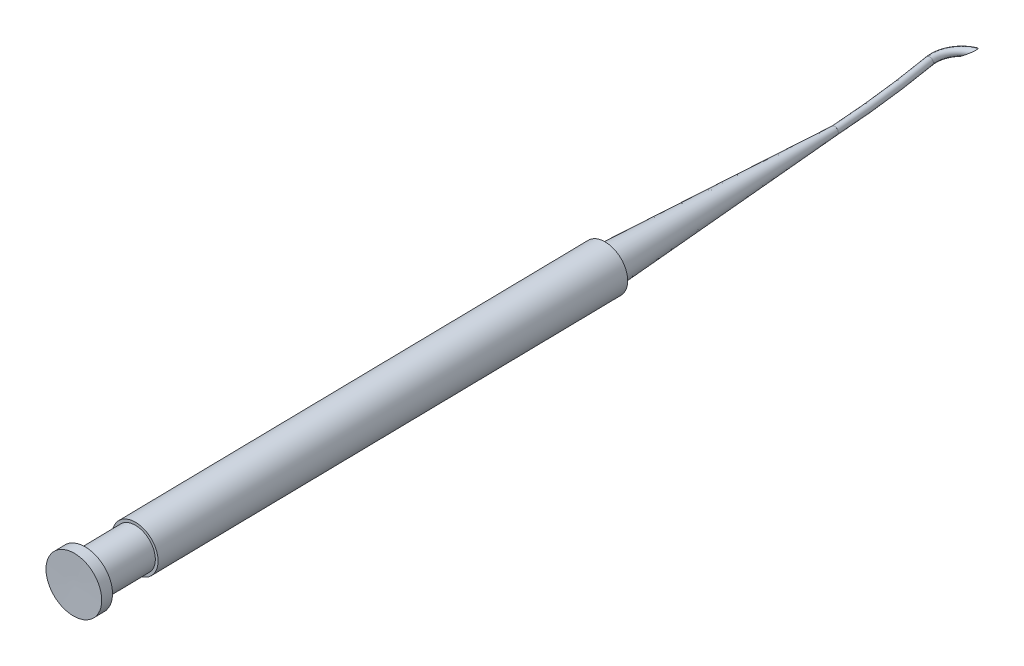
ISO-10303-21;
HEADER;
FILE_DESCRIPTION(('STEP AP214'),'2;1');
FILE_NAME('part.step','',(''),(''),'','','');
FILE_SCHEMA(('AUTOMOTIVE_DESIGN { 1 0 10303 214 1 1 1 1 }'));
ENDSEC;
DATA;
#1=APPLICATION_CONTEXT('core data for automotive mechanical design processes');
#2=APPLICATION_PROTOCOL_DEFINITION('international standard','automotive_design',2000,#1);
#3=PRODUCT_CONTEXT('',#1,'mechanical');
#4=PRODUCT('Part','Part','',(#3));
#5=PRODUCT_RELATED_PRODUCT_CATEGORY('part','',(#4));
#6=PRODUCT_DEFINITION_FORMATION('','',#4);
#7=PRODUCT_DEFINITION_CONTEXT('part definition',#1,'design');
#8=PRODUCT_DEFINITION('design','',#6,#7);
#9=PRODUCT_DEFINITION_SHAPE('','',#8);
#10=(LENGTH_UNIT() NAMED_UNIT(*) SI_UNIT(.MILLI.,.METRE.));
#11=(NAMED_UNIT(*) PLANE_ANGLE_UNIT() SI_UNIT($,.RADIAN.));
#12=(NAMED_UNIT(*) SI_UNIT($,.STERADIAN.) SOLID_ANGLE_UNIT());
#13=UNCERTAINTY_MEASURE_WITH_UNIT(LENGTH_MEASURE(1.E-05),#10,'distance_accuracy_value','');
#14=(GEOMETRIC_REPRESENTATION_CONTEXT(3) GLOBAL_UNCERTAINTY_ASSIGNED_CONTEXT((#13)) GLOBAL_UNIT_ASSIGNED_CONTEXT((#10,
#11,#12)) REPRESENTATION_CONTEXT('',''));
#15=CARTESIAN_POINT('',(0.,0.,0.));
#16=DIRECTION('',(0.,0.,1.));
#17=DIRECTION('',(1.,0.,0.));
#18=AXIS2_PLACEMENT_3D('',#15,#16,#17);
#19=CARTESIAN_POINT('',(22.5831114339788,9.8277538825437E-11,-64.5016753142618));
#20=DIRECTION('',(-0.109478747496273,1.17499877810958E-08,-0.993989136684424));
#21=DIRECTION('',(6.96705910834885E-07,-0.999999999999753,-8.8556780978676E-08));
#22=AXIS2_PLACEMENT_3D('',#19,#20,#21);
#23=ELLIPSE('',#22,0.499930018106646,0.499860046008388);
#24=CARTESIAN_POINT('',(26.3470233288516,0.,-65.1616041607414));
#25=DIRECTION('',(0.,-1.,0.));
#26=AXIS1_PLACEMENT('',#24,#25);
#27=SURFACE_OF_REVOLUTION('',#23,#26);
#28=CARTESIAN_POINT('',(22.583111782283,-0.499930018008245,-64.501675358534));
#29=VERTEX_POINT('',#28);
#30=EDGE_CURVE('E11',#29,#29,#23,.T.);
#31=ORIENTED_EDGE('',*,*,#30,.T.);
#32=EDGE_LOOP('',(#31));
#33=FACE_BOUND('',#32,.T.);
#34=CARTESIAN_POINT('',(23.4789167075342,-0.499930018008245,-67.6867775336271));
#35=CARTESIAN_POINT('',(23.4874966298607,-0.499922539838258,-67.6596179954472));
#36=CARTESIAN_POINT('',(23.4991178717487,-0.498113027047626,-67.633192326966));
#37=CARTESIAN_POINT('',(23.5220054699255,-0.491710849953837,-67.5974919130645));
#38=CARTESIAN_POINT('',(23.5306238073087,-0.488929440464561,-67.5861832491793));
#39=CARTESIAN_POINT('',(23.5495695594943,-0.482079781529989,-67.5655570977329));
#40=CARTESIAN_POINT('',(23.5598947935907,-0.478013168074712,-67.5562371038382));
#41=CARTESIAN_POINT('',(23.5802328042653,-0.469427725007459,-67.5411916823178));
#42=CARTESIAN_POINT('',(23.5900722557496,-0.465060905489362,-67.5351404864551));
#43=CARTESIAN_POINT('',(23.6103701263734,-0.455677162211372,-67.524819048566));
#44=CARTESIAN_POINT('',(23.6208296507264,-0.450659057451415,-67.5205521028228));
#45=CARTESIAN_POINT('',(23.6465426982068,-0.43794732030239,-67.5122249108725));
#46=CARTESIAN_POINT('',(23.6619523396238,-0.430019913611097,-67.5090157962757));
#47=CARTESIAN_POINT('',(23.6928245190423,-0.413668675975096,-67.5052883362523));
#48=CARTESIAN_POINT('',(23.7082870954326,-0.405243703576949,-67.5047764417567));
#49=CARTESIAN_POINT('',(23.737902559818,-0.388766205218424,-67.5057604163133));
#50=CARTESIAN_POINT('',(23.7520706037626,-0.380729598879681,-67.5071165661881));
#51=CARTESIAN_POINT('',(23.7801289796391,-0.364573667587392,-67.5111856553017));
#52=CARTESIAN_POINT('',(23.7940196214762,-0.356454452237391,-67.5138969808756));
#53=CARTESIAN_POINT('',(23.8215780275406,-0.340153652987961,-67.5203853907922));
#54=CARTESIAN_POINT('',(23.8352447778734,-0.33197194948345,-67.5241663783844));
#55=CARTESIAN_POINT('',(23.862315529857,-0.315607230266437,-67.5325689527492));
#56=CARTESIAN_POINT('',(23.8757194846719,-0.307424214577414,-67.5371906878794));
#57=CARTESIAN_POINT('',(23.9131667048235,-0.284378342511033,-67.5511656999159));
#58=CARTESIAN_POINT('',(23.9369315235763,-0.26953425252005,-67.5612937308752));
#59=CARTESIAN_POINT('',(23.9838007444835,-0.2399390323592,-67.5831083650033));
#60=CARTESIAN_POINT('',(24.0069046819498,-0.225187973020344,-67.5947960336085));
#61=CARTESIAN_POINT('',(24.0754823582676,-0.181035770327077,-67.6316051845266));
#62=CARTESIAN_POINT('',(24.1201344409228,-0.151790135457073,-67.6584362847414));
#63=CARTESIAN_POINT('',(24.2080464302558,-0.0935580425619982,-67.7150199966887));
#64=CARTESIAN_POINT('',(24.2512991348245,-0.0645733527040405,-67.7447852613265));
#65=CARTESIAN_POINT('',(24.3364346274478,-0.00699351117532545,-67.8064160904951));
#66=CARTESIAN_POINT('',(24.3783191605603,0.0216021072052781,-67.8382788097071));
#67=CARTESIAN_POINT('',(24.4568481353309,0.0756991068713183,-67.9008008977525));
#68=CARTESIAN_POINT('',(24.4936102773659,0.101234562084873,-67.9312833004158));
#69=CARTESIAN_POINT('',(24.5659116152841,0.151929616554021,-67.9939612209899));
#70=CARTESIAN_POINT('',(24.6014509539131,0.177089259485272,-68.0261565378161));
#71=CARTESIAN_POINT('',(24.6708393786765,0.226827798323792,-68.09256208874));
#72=CARTESIAN_POINT('',(24.7046922190613,0.251407913488138,-68.1267674406523));
#73=CARTESIAN_POINT('',(24.7699951949769,0.299719555552766,-68.1979096223693));
#74=CARTESIAN_POINT('',(24.8014481871818,0.323452072905243,-68.2348430982604));
#75=CARTESIAN_POINT('',(24.8554032558391,0.365513521509206,-68.305974306849));
#76=CARTESIAN_POINT('',(24.878515193272,0.384070965688318,-68.339554286647));
#77=CARTESIAN_POINT('',(24.9097141439607,0.410460886887004,-68.3925948880169));
#78=CARTESIAN_POINT('',(24.9195165470632,0.418998020381074,-68.4106743817307));
#79=CARTESIAN_POINT('',(24.9375847063136,0.43540519955492,-68.4478641190111));
#80=CARTESIAN_POINT('',(24.9458500252793,0.443275055100273,-68.4669746538416));
#81=CARTESIAN_POINT('',(24.9651088901834,0.462999797497797,-68.5194922396621));
#82=CARTESIAN_POINT('',(24.97429834211,0.474053290575408,-68.5540046282334));
#83=CARTESIAN_POINT('',(24.9807397230262,0.48695652639981,-68.6078808285763));
#84=CARTESIAN_POINT('',(24.9816409056787,0.490658613966195,-68.6263407510652));
#85=CARTESIAN_POINT('',(24.9802622323442,0.496336903765829,-68.6634081827675));
#86=CARTESIAN_POINT('',(24.9779915578946,0.498318060666896,-68.6820151116074));
#87=CARTESIAN_POINT('',(24.9709072673643,0.499993472269842,-68.7141230623619));
#88=CARTESIAN_POINT('',(24.9668435578089,0.500125692017693,-68.7277683711388));
#89=CARTESIAN_POINT('',(24.9567473800998,0.499168574704634,-68.7542670393061));
#90=CARTESIAN_POINT('',(24.950715091339,0.498079348929742,-68.7671204707322));
#91=CARTESIAN_POINT('',(24.9369407014494,0.494753154595339,-68.7916394276025));
#92=CARTESIAN_POINT('',(24.9292051402428,0.49252053390272,-68.8033092538599));
#93=CARTESIAN_POINT('',(24.9123305356752,0.487056331570419,-68.8253464878663));
#94=CARTESIAN_POINT('',(24.9031885634689,0.483822650664441,-68.8357110936466));
#95=CARTESIAN_POINT('',(24.8795434039081,0.474912354015089,-68.8593712627208));
#96=CARTESIAN_POINT('',(24.8644637242696,0.468788811244467,-68.8719211259236));
#97=CARTESIAN_POINT('',(24.8329329347905,0.455317201228225,-68.8943179881911));
#98=CARTESIAN_POINT('',(24.8164796927668,0.447967211818271,-68.9041606792511));
#99=CARTESIAN_POINT('',(24.7736534000257,0.42820232655429,-68.9261323510813));
#100=CARTESIAN_POINT('',(24.7467206293752,0.415195349504142,-68.9366266379133));
#101=CARTESIAN_POINT('',(24.6921115949708,0.387974875095077,-68.9530251465872));
#102=CARTESIAN_POINT('',(24.664433926231,0.373758969939492,-68.9589199585129));
#103=CARTESIAN_POINT('',(24.5916568693747,0.335511027576955,-68.9694224452733));
#104=CARTESIAN_POINT('',(24.546432758619,0.310874899963703,-68.970947118899));
#105=CARTESIAN_POINT('',(24.4568984012815,0.260765570710296,-68.9662790799544));
#106=CARTESIAN_POINT('',(24.412590240764,0.235290741499975,-68.9600703817609));
#107=CARTESIAN_POINT('',(24.3050282875379,0.172030851302187,-68.9368360446869));
#108=CARTESIAN_POINT('',(24.2426620946954,0.134089613158125,-68.9160969860722));
#109=CARTESIAN_POINT('',(24.1225717181909,0.0588247573493645,-68.8634577448738));
#110=CARTESIAN_POINT('',(24.0648490196514,0.0215013402889497,-68.8315540088234));
#111=CARTESIAN_POINT('',(23.9535113806371,-0.0527047813911042,-68.7572605928567));
#112=CARTESIAN_POINT('',(23.9000354623301,-0.0895530580752701,-68.714628384566));
#113=CARTESIAN_POINT('',(23.7997290483326,-0.161134029886636,-68.6204764933182));
#114=CARTESIAN_POINT('',(23.7529125367563,-0.195862188215514,-68.5689385972947));
#115=CARTESIAN_POINT('',(23.6607489040934,-0.267328339788732,-68.4496312111193));
#116=CARTESIAN_POINT('',(23.6166488268582,-0.303600887394179,-68.3805880735038));
#117=CARTESIAN_POINT('',(23.5604398690361,-0.353702808534918,-68.2703046880576));
#118=CARTESIAN_POINT('',(23.5433792232419,-0.369664178874372,-68.2324876618111));
#119=CARTESIAN_POINT('',(23.5130732009439,-0.399857506943634,-68.1547155081922));
#120=CARTESIAN_POINT('',(23.4998227803194,-0.414091736554149,-68.1147632913834));
#121=CARTESIAN_POINT('',(23.4800666254365,-0.437819019589966,-68.0407751943486));
#122=CARTESIAN_POINT('',(23.4727535852037,-0.447697298103827,-68.0070806956675));
#123=CARTESIAN_POINT('',(23.4618555497138,-0.465606902571051,-67.9385069522294));
#124=CARTESIAN_POINT('',(23.4582773539547,-0.473634839248143,-67.9036256656076));
#125=CARTESIAN_POINT('',(23.4562215016887,-0.486162908033941,-67.8380054319947));
#126=CARTESIAN_POINT('',(23.4571057804647,-0.490997735336491,-67.807362245954));
#127=CARTESIAN_POINT('',(23.4621681137548,-0.49615133724932,-67.7616370130987));
#128=CARTESIAN_POINT('',(23.4644674418326,-0.497518578106189,-67.7464742491026));
#129=CARTESIAN_POINT('',(23.4705193053329,-0.499410121126964,-67.7163950890753));
#130=CARTESIAN_POINT('',(23.4742724560723,-0.499934065888934,-67.7014788001533));
#131=CARTESIAN_POINT('',(23.4789167075342,-0.499930018008245,-67.6867775336271));
#132=B_SPLINE_CURVE_WITH_KNOTS('',3,(#34,#35,#36,#37,#38,#39,#40,#41,#42,#43,#44,#45,#46,#47,
#48,#49,#50,#51,#52,#53,#54,#55,#56,#57,#58,#59,#60,#61,#62,#63,#64,#65,#66,#67,#68,#69,#70,#71,
#72,#73,#74,#75,#76,#77,#78,#79,#80,#81,#82,#83,#84,#85,#86,#87,#88,#89,#90,#91,#92,#93,#94,#95,
#96,#97,#98,#99,#100,#101,#102,#103,#104,#105,#106,#107,#108,#109,#110,#111,#112,#113,#114,#115,
#116,#117,#118,#119,#120,#121,#122,#123,#124,#125,#126,#127,#128,#129,#130,#131),.UNSPECIFIED.,
.T.,.F.,(4,2,2,2,2,2,2,2,2,2,2,2,2,2,2,2,2,2,2,2,2,2,2,2,2,2,2,2,2,2,2,2,2,2,2,2,2,2,2,2,2,2,2,
2,2,2,2,2,4),(0.,0.0852063214918791,0.128417850991578,0.171574594786311,0.208448829189027,
0.245390888487316,0.297961542778718,0.350657873221296,0.399619614890309,0.448523194139345,
0.497607579136256,0.546700633933774,0.636006070123902,0.725372828943218,0.904433292210296,
1.08430283095376,1.26393320361352,1.4263614905045,1.58877075130074,1.75080065015548,
1.9126345650802,2.04670359965181,2.11342377830948,2.18016290479438,2.29098532503552,
2.34726672830694,2.40338555164556,2.4458999750825,2.48841052534095,2.53076061240355,
2.57320011800483,2.63450850384706,2.69591389441808,2.79047202555921,2.88522310653068,
3.03892907081035,3.19295328804407,3.41939855173804,3.64591595353208,3.87810443446597,
4.11077351006566,4.37793987580824,4.51111027966967,4.64410356720939,4.75149849939878,
4.85908861098387,4.95177021644145,4.9978722638897,5.04399384495915),.UNSPECIFIED.);
#133=CARTESIAN_POINT('',(23.4789167075342,-0.499930018008245,-67.6867775336271));
#134=VERTEX_POINT('',#133);
#135=EDGE_CURVE('E79',#134,#134,#132,.T.);
#136=ORIENTED_EDGE('',*,*,#135,.T.);
#137=EDGE_LOOP('',(#136));
#138=FACE_BOUND('',#137,.T.);
#139=ADVANCED_FACE('F42',(#33,#138),#27,.F.);
#140=CARTESIAN_POINT('',(22.5831114339788,9.8277538825437E-11,-64.5016753142618));
#141=DIRECTION('',(-0.109478747496273,1.17499877810958E-08,-0.993989136684424));
#142=DIRECTION('',(1.28637394537087E-09,1.,1.16793602105839E-08));
#143=AXIS2_PLACEMENT_3D('',#140,#141,#142);
#144=CIRCLE('',#143,0.150000000000002);
#145=CARTESIAN_POINT('',(26.3470233288516,0.,-65.1616041607414));
#146=DIRECTION('',(0.,-1.,0.));
#147=AXIS1_PLACEMENT('',#145,#146);
#148=SURFACE_OF_REVOLUTION('',#144,#147);
#149=CARTESIAN_POINT('',(22.5831114341717,0.150000000098279,-64.5016753125099));
#150=VERTEX_POINT('',#149);
#151=EDGE_CURVE('E50',#150,#150,#144,.T.);
#152=ORIENTED_EDGE('',*,*,#151,.F.);
#153=EDGE_LOOP('',(#152));
#154=FACE_BOUND('',#153,.T.);
#155=CARTESIAN_POINT('',(24.4157371071417,0.150000000098279,-68.4589777163875));
#156=CARTESIAN_POINT('',(24.4142710853937,0.150000076328208,-68.4636261695504));
#157=CARTESIAN_POINT('',(24.4124264922115,0.149771197351919,-68.4681565266262));
#158=CARTESIAN_POINT('',(24.407996312203,0.14883047526385,-68.4767855848725));
#159=CARTESIAN_POINT('',(24.4054109731304,0.148118793524122,-68.480884429743));
#160=CARTESIAN_POINT('',(24.3996298090631,0.146253939627511,-68.4884755007737));
#161=CARTESIAN_POINT('',(24.3964367746203,0.145102762236857,-68.4919703656355));
#162=CARTESIAN_POINT('',(24.3895921452486,0.142437384493779,-68.4983236240004));
#163=CARTESIAN_POINT('',(24.3859392136371,0.140922113748895,-68.5011800919848));
#164=CARTESIAN_POINT('',(24.3722910159743,0.134993995519197,-68.5103167298816));
#165=CARTESIAN_POINT('',(24.3614490571251,0.129805719551828,-68.5148163135146));
#166=CARTESIAN_POINT('',(24.3413683755161,0.119694529003867,-68.5202604157134));
#167=CARTESIAN_POINT('',(24.3321695772978,0.114875826470541,-68.5216784206928));
#168=CARTESIAN_POINT('',(24.3137742002582,0.104978710268638,-68.5230119424734));
#169=CARTESIAN_POINT('',(24.3045776895042,0.0998996533963149,-68.5229235398142));
#170=CARTESIAN_POINT('',(24.2788253887357,0.0853929683666589,-68.521039633179));
#171=CARTESIAN_POINT('',(24.2624540055977,0.0758328639094346,-68.5178966518499));
#172=CARTESIAN_POINT('',(24.2304894342157,0.0566811943063825,-68.5089622715144));
#173=CARTESIAN_POINT('',(24.2148981053724,0.0470896071275913,-68.5031648504195));
#174=CARTESIAN_POINT('',(24.1755083555094,0.0223183960099349,-68.4854138846467));
#175=CARTESIAN_POINT('',(24.1523758029141,0.00722609490043105,-68.4718520242186));
#176=CARTESIAN_POINT('',(24.1085932952459,-0.0223075205993808,-68.440605709956));
#177=CARTESIAN_POINT('',(24.0879477502232,-0.0367476510085163,-68.4229140916036));
#178=CARTESIAN_POINT('',(24.0531632149437,-0.0620720554242716,-68.3873769559858));
#179=CARTESIAN_POINT('',(24.0385235032155,-0.0731258437272038,-68.370142887424));
#180=CARTESIAN_POINT('',(24.0118895338344,-0.0941914602194916,-68.3332870983584));
#181=CARTESIAN_POINT('',(23.999882553516,-0.104208170185414,-68.3136776050732));
#182=CARTESIAN_POINT('',(23.9817683502355,-0.120676730825175,-68.2762804074247));
#183=CARTESIAN_POINT('',(23.9749489566109,-0.127433207029412,-68.2589965616805));
#184=CARTESIAN_POINT('',(23.9675395223182,-0.136250041297197,-68.2317196183609));
#185=CARTESIAN_POINT('',(23.9655363147787,-0.138981630016445,-68.2223419226479));
#186=CARTESIAN_POINT('',(23.9628896706269,-0.143754836759356,-68.2032483285854));
#187=CARTESIAN_POINT('',(23.962240546928,-0.145799310129542,-68.1935340196452));
#188=CARTESIAN_POINT('',(23.9629158322241,-0.14882076894991,-68.1739950655551));
#189=CARTESIAN_POINT('',(23.9642237681516,-0.149806546083709,-68.1641720244839));
#190=CARTESIAN_POINT('',(23.9682613492285,-0.150059583927777,-68.1499138690906));
#191=CARTESIAN_POINT('',(23.9699738323686,-0.149934030925493,-68.1452074013743));
#192=CARTESIAN_POINT('',(23.9741650761741,-0.149192146827235,-68.1361909532497));
#193=CARTESIAN_POINT('',(23.976642200099,-0.148576859625876,-68.1318801512333));
#194=CARTESIAN_POINT('',(23.9819467720588,-0.146955175806111,-68.1243999070223));
#195=CARTESIAN_POINT('',(23.9846867731105,-0.146010044738414,-68.1211549397557));
#196=CARTESIAN_POINT('',(23.9906097787375,-0.143777170406623,-68.1152332718524));
#197=CARTESIAN_POINT('',(23.9937934165104,-0.142488934995397,-68.1125573975152));
#198=CARTESIAN_POINT('',(24.0047918634678,-0.137789317660998,-68.1047479070574));
#199=CARTESIAN_POINT('',(24.0132749625436,-0.133785521041922,-68.1009066848671));
#200=CARTESIAN_POINT('',(24.0286605885956,-0.126105586377566,-68.0963487337598));
#201=CARTESIAN_POINT('',(24.0355090813711,-0.122545239928488,-68.0951365764617));
#202=CARTESIAN_POINT('',(24.049220115629,-0.115221223178427,-68.0938384865822));
#203=CARTESIAN_POINT('',(24.0560826515158,-0.111457086745429,-68.0937552557924));
#204=CARTESIAN_POINT('',(24.0762685672584,-0.100169458039263,-68.0947515982272));
#205=CARTESIAN_POINT('',(24.089446972998,-0.0925178256985973,-68.0970286588316));
#206=CARTESIAN_POINT('',(24.1152677579256,-0.077169270671369,-68.1035430372937));
#207=CARTESIAN_POINT('',(24.1279084080767,-0.0694722809809396,-68.107786222871));
#208=CARTESIAN_POINT('',(24.1537998501554,-0.0534240351346843,-68.1181054969046));
#209=CARTESIAN_POINT('',(24.1670002741928,-0.0450775165493272,-68.1243139969241));
#210=CARTESIAN_POINT('',(24.1928140028123,-0.0284918883147451,-68.1379739810225));
#211=CARTESIAN_POINT('',(24.2054267730467,-0.0202528811421779,-68.1454265691739));
#212=CARTESIAN_POINT('',(24.2424629749195,0.00429297695844041,-68.1693418335042));
#213=CARTESIAN_POINT('',(24.2660424617653,0.0204024331031969,-68.187343606528));
#214=CARTESIAN_POINT('',(24.3061414089616,0.0486569638720654,-68.2229034881995));
#215=CARTESIAN_POINT('',(24.3231283377878,0.0609491203730837,-68.239826407708));
#216=CARTESIAN_POINT('',(24.3548304118345,0.084696745897827,-68.2760571658182));
#217=CARTESIAN_POINT('',(24.3695575764629,0.0961564578001138,-68.2953513280148));
#218=CARTESIAN_POINT('',(24.3921307899944,0.114915590778805,-68.3318006802923));
#219=CARTESIAN_POINT('',(24.4007747048724,0.122532948679198,-68.3482569634334));
#220=CARTESIAN_POINT('',(24.4109663078961,0.132732900577533,-68.3746772325103));
#221=CARTESIAN_POINT('',(24.4139114573452,0.135946096884223,-68.3838416675271));
#222=CARTESIAN_POINT('',(24.4183481639022,0.141671652751077,-68.4027436323151));
#223=CARTESIAN_POINT('',(24.4198445597299,0.144186325114244,-68.4124791383809));
#224=CARTESIAN_POINT('',(24.4204752124066,0.147314916905457,-68.428494509047));
#225=CARTESIAN_POINT('',(24.4202944384096,0.14828795456778,-68.4346705335737));
#226=CARTESIAN_POINT('',(24.4188555914004,0.149628931822815,-68.4469539175333));
#227=CARTESIAN_POINT('',(24.4176029646854,0.149999903077762,-68.4530614662286));
#228=CARTESIAN_POINT('',(24.4157371071417,0.150000000098279,-68.4589777163875));
#229=B_SPLINE_CURVE_WITH_KNOTS('',3,(#155,#156,#157,#158,#159,#160,#161,#162,#163,#164,#165,
#166,#167,#168,#169,#170,#171,#172,#173,#174,#175,#176,#177,#178,#179,#180,#181,#182,#183,#184,
#185,#186,#187,#188,#189,#190,#191,#192,#193,#194,#195,#196,#197,#198,#199,#200,#201,#202,#203,
#204,#205,#206,#207,#208,#209,#210,#211,#212,#213,#214,#215,#216,#217,#218,#219,#220,#221,#222,
#223,#224,#225,#226,#227,#228),.UNSPECIFIED.,.T.,.F.,(4,2,2,2,2,2,2,2,2,2,2,2,2,2,2,2,2,2,2,2,2,
2,2,2,2,2,2,2,2,2,2,2,2,2,2,2,4),(0.,0.0145984966594061,0.029192116318066,0.0437202716644643,
0.0582916722487111,0.0960388982931043,0.127384676267737,0.158812023963596,0.2161525979892,
0.273623909277741,0.365453087278887,0.457442775089019,0.532726344778894,0.60763767092829,
0.666567260693061,0.696390747324982,0.726088722470404,0.755538124437427,0.770486715069125,
0.785403527038588,0.798380531650621,0.811376251608565,0.841165519472578,0.864525307246651,
0.8879409907518,0.933915205774559,0.980027519196332,1.03036898105267,1.08075535855007,
1.18168479164044,1.26237090172165,1.34261174986507,1.40249842443594,1.43285746010116,
1.46311474562402,1.48178909522111,1.50036911639283),.UNSPECIFIED.);
#230=CARTESIAN_POINT('',(24.4157371071417,0.150000000098279,-68.4589777163875));
#231=VERTEX_POINT('',#230);
#232=EDGE_CURVE('E73',#231,#231,#229,.T.);
#233=ORIENTED_EDGE('',*,*,#232,.F.);
#234=EDGE_LOOP('',(#233));
#235=FACE_BOUND('',#234,.T.);
#236=ADVANCED_FACE('F67',(#154,#235),#148,.T.);
#237=CARTESIAN_POINT('',(-110.498865130992,0.,-41.1686652008343));
#238=DIRECTION('',(0.,-1.,0.));
#239=AXIS1_PLACEMENT('',#237,#238);
#240=SURFACE_OF_REVOLUTION('',#144,#239);
#241=ORIENTED_EDGE('',*,*,#151,.T.);
#242=EDGE_LOOP('',(#241));
#243=FACE_BOUND('',#242,.T.);
#244=CARTESIAN_POINT('',(24.337642585616,9.8277538825437E-11,-49.7917756710677));
#245=DIRECTION('',(0.,1.17499877810958E-08,-1.));
#246=DIRECTION('',(0.,1.,1.17499877810958E-08));
#247=AXIS2_PLACEMENT_3D('',#244,#245,#246);
#248=CIRCLE('',#247,0.150000000000002);
#249=CARTESIAN_POINT('',(24.337642585616,0.150000000098279,-49.7917756693052));
#250=VERTEX_POINT('',#249);
#251=EDGE_CURVE('E58',#250,#250,#248,.T.);
#252=ORIENTED_EDGE('',*,*,#251,.F.);
#253=EDGE_LOOP('',(#252));
#254=FACE_BOUND('',#253,.T.);
#255=ADVANCED_FACE('F64',(#243,#254),#240,.F.);
#256=CARTESIAN_POINT('',(-110.498865130992,0.,-41.1686652008343));
#257=DIRECTION('',(0.,-1.,0.));
#258=AXIS1_PLACEMENT('',#256,#257);
#259=SURFACE_OF_REVOLUTION('',#23,#258);
#260=ORIENTED_EDGE('',*,*,#30,.F.);
#261=EDGE_LOOP('',(#260));
#262=FACE_BOUND('',#261,.T.);
#263=CARTESIAN_POINT('',(24.337642585616,9.8277538825437E-11,-49.7917756710677));
#264=DIRECTION('',(0.,1.17499877810958E-08,-1.));
#265=DIRECTION('',(7.0221319229755E-07,-0.999999999999753,-1.17499877810929E-08));
#266=AXIS2_PLACEMENT_3D('',#263,#264,#265);
#267=ELLIPSE('',#266,0.499930018106646,0.499860046008388);
#268=CARTESIAN_POINT('',(24.3376429366734,-0.499930018008245,-49.7917756769419));
#269=VERTEX_POINT('',#268);
#270=EDGE_CURVE('E54',#269,#269,#267,.T.);
#271=ORIENTED_EDGE('',*,*,#270,.T.);
#272=EDGE_LOOP('',(#271));
#273=FACE_BOUND('',#272,.T.);
#274=ADVANCED_FACE('F71',(#262,#273),#259,.T.);
#275=CARTESIAN_POINT('',(24.337642585616,9.8277538825437E-11,-49.7917756710677));
#276=DIRECTION('',(0.,1.17499877810958E-08,-1.));
#277=DIRECTION('',(0.,1.,1.17499877810958E-08));
#278=AXIS2_PLACEMENT_3D('',#275,#276,#277);
#279=PLANE('',#278);
#280=ORIENTED_EDGE('',*,*,#251,.T.);
#281=EDGE_LOOP('',(#280));
#282=FACE_BOUND('',#281,.T.);
#283=ORIENTED_EDGE('',*,*,#270,.F.);
#284=EDGE_LOOP('',(#283));
#285=FACE_BOUND('',#284,.T.);
#286=ADVANCED_FACE('F85',(#282,#285),#279,.F.);
#287=CARTESIAN_POINT('',(10.3994020225061,-18.8870061251815,-3.28005655924495));
#288=DIRECTION('',(0.476843512199102,-0.866025403784438,-0.150400348648619));
#289=DIRECTION('',(0.875989633236581,0.482329931128102,0.));
#290=AXIS2_PLACEMENT_3D('',#287,#288,#289);
#291=PLANE('',#290);
#292=ORIENTED_EDGE('',*,*,#135,.F.);
#293=EDGE_LOOP('',(#292));
#294=FACE_BOUND('',#293,.T.);
#295=ORIENTED_EDGE('',*,*,#232,.T.);
#296=EDGE_LOOP('',(#295));
#297=FACE_BOUND('',#296,.T.);
#298=ADVANCED_FACE('F82',(#294,#297),#291,.T.);
#299=CLOSED_SHELL('',(#139,#236,#255,#274,#286,#298));
#300=MANIFOLD_SOLID_BREP('B2',#299);
#301=CARTESIAN_POINT('',(24.337642585616,0.,-49.7834116165124));
#302=DIRECTION('',(0.0167304507679107,0.,0.999860036213621));
#303=DIRECTION('',(0.999860036213621,0.,-0.0167304507679107));
#304=AXIS2_PLACEMENT_3D('',#301,#302,#303);
#305=CONICAL_SURFACE('',#304,0.499930018106645,1.55406509543088);
#306=CARTESIAN_POINT('',(24.3375026316244,0.,-49.7917756710677));
#307=VERTEX_POINT('',#306);
#308=VERTEX_LOOP('',#307);
#309=FACE_BOUND('',#308,.T.);
#310=CARTESIAN_POINT('',(24.337642585616,0.,-49.7834116165124));
#311=DIRECTION('',(-0.0167304507679107,0.,-0.999860036213621));
#312=DIRECTION('',(-0.999860036213621,0.,0.0167304507679107));
#313=AXIS2_PLACEMENT_3D('',#310,#311,#312);
#314=CIRCLE('',#313,0.499930018106646);
#315=CARTESIAN_POINT('',(23.8377825396076,0.,-49.7750475619571));
#316=VERTEX_POINT('',#315);
#317=EDGE_CURVE('E40',#316,#316,#314,.T.);
#318=ORIENTED_EDGE('',*,*,#317,.T.);
#319=EDGE_LOOP('',(#318));
#320=FACE_BOUND('',#319,.T.);
#321=ADVANCED_FACE('F145',(#309,#320),#305,.T.);
#322=CARTESIAN_POINT('',(24.8726600990155,0.,-17.809220499765));
#323=DIRECTION('',(0.0167304507679107,0.,0.999860036213621));
#324=DIRECTION('',(0.999860036213621,0.,-0.0167304507679107));
#325=AXIS2_PLACEMENT_3D('',#322,#323,#324);
#326=CONICAL_SURFACE('',#325,2.29127121935524,0.0559582753425584);
#327=ORIENTED_EDGE('',*,*,#317,.F.);
#328=EDGE_LOOP('',(#327));
#329=FACE_BOUND('',#328,.T.);
#330=CARTESIAN_POINT('',(24.8726600990155,0.,-17.809220499765));
#331=DIRECTION('',(-0.0167304507679107,0.,-0.999860036213621));
#332=DIRECTION('',(-0.999860036213621,0.,0.0167304507679107));
#333=AXIS2_PLACEMENT_3D('',#330,#331,#332);
#334=CIRCLE('',#333,2.29127121935524);
#335=CARTESIAN_POINT('',(22.5817095746557,0.,-17.7708864994337));
#336=VERTEX_POINT('',#335);
#337=EDGE_CURVE('E152',#336,#336,#334,.T.);
#338=ORIENTED_EDGE('',*,*,#337,.T.);
#339=EDGE_LOOP('',(#338));
#340=FACE_BOUND('',#339,.T.);
#341=ADVANCED_FACE('F171',(#329,#340),#326,.T.);
#342=CARTESIAN_POINT('',(24.8728865003451,0.,-17.7956901027158));
#343=DIRECTION('',(0.0167304507679107,0.,0.999860036213621));
#344=DIRECTION('',(0.999860036213621,0.,-0.0167304507679107));
#345=AXIS2_PLACEMENT_3D('',#342,#343,#344);
#346=CONICAL_SURFACE('',#345,3.1,1.55406509543087);
#347=ORIENTED_EDGE('',*,*,#337,.F.);
#348=EDGE_LOOP('',(#347));
#349=FACE_BOUND('',#348,.T.);
#350=CARTESIAN_POINT('',(24.8728865003451,0.,-17.7956901027158));
#351=DIRECTION('',(-0.0167304507679107,0.,-0.999860036213621));
#352=DIRECTION('',(-0.999860036213621,0.,0.0167304507679107));
#353=AXIS2_PLACEMENT_3D('',#350,#351,#352);
#354=CIRCLE('',#353,3.1);
#355=CARTESIAN_POINT('',(21.7733203880829,0.,-17.7438257053353));
#356=VERTEX_POINT('',#355);
#357=EDGE_CURVE('E183',#356,#356,#354,.T.);
#358=ORIENTED_EDGE('',*,*,#357,.T.);
#359=EDGE_LOOP('',(#358));
#360=FACE_BOUND('',#359,.T.);
#361=ADVANCED_FACE('F175',(#349,#360),#346,.T.);
#362=CARTESIAN_POINT('',(24.8861041465377,0.,-17.0057654088692));
#363=DIRECTION('',(-0.0167304507679107,0.,-0.999860036213621));
#364=DIRECTION('',(-0.999860036213621,0.,0.0167304507679107));
#365=AXIS2_PLACEMENT_3D('',#362,#363,#364);
#366=CYLINDRICAL_SURFACE('',#365,3.1);
#367=ORIENTED_EDGE('',*,*,#357,.F.);
#368=EDGE_LOOP('',(#367));
#369=FACE_BOUND('',#368,.T.);
#370=CARTESIAN_POINT('',(25.9660800783786,0.,47.5367140078499));
#371=DIRECTION('',(-0.0167304507679107,0.,-0.999860036213621));
#372=DIRECTION('',(-0.999860036213621,0.,0.0167304507679107));
#373=AXIS2_PLACEMENT_3D('',#370,#371,#372);
#374=CIRCLE('',#373,3.1);
#375=CARTESIAN_POINT('',(22.8665139661164,0.,47.5885784052304));
#376=VERTEX_POINT('',#375);
#377=EDGE_CURVE('E185',#376,#376,#374,.T.);
#378=ORIENTED_EDGE('',*,*,#377,.T.);
#379=EDGE_LOOP('',(#378));
#380=FACE_BOUND('',#379,.T.);
#381=ADVANCED_FACE('F218',(#369,#380),#366,.T.);
#382=CARTESIAN_POINT('',(25.9659750981916,0.,47.5304400888119));
#383=DIRECTION('',(0.0167304507679107,0.,0.999860036213621));
#384=DIRECTION('',(0.999860036213621,0.,-0.0167304507679107));
#385=AXIS2_PLACEMENT_3D('',#382,#383,#384);
#386=CONICAL_SURFACE('',#385,2.725,1.55406509543086);
#387=ORIENTED_EDGE('',*,*,#377,.F.);
#388=EDGE_LOOP('',(#387));
#389=FACE_BOUND('',#388,.T.);
#390=CARTESIAN_POINT('',(25.9659750981916,0.,47.5304400888119));
#391=DIRECTION('',(-0.0167304507679107,0.,-0.999860036213621));
#392=DIRECTION('',(-0.999860036213621,0.,0.0167304507679107));
#393=AXIS2_PLACEMENT_3D('',#390,#391,#392);
#394=CIRCLE('',#393,2.725);
#395=CARTESIAN_POINT('',(23.2413564995095,0.,47.5760305671545));
#396=VERTEX_POINT('',#395);
#397=EDGE_CURVE('E190',#396,#396,#394,.T.);
#398=ORIENTED_EDGE('',*,*,#397,.T.);
#399=EDGE_LOOP('',(#398));
#400=FACE_BOUND('',#399,.T.);
#401=ADVANCED_FACE('F211',(#389,#400),#386,.F.);
#402=CARTESIAN_POINT('',(24.8861041465377,0.,-17.0057654088692));
#403=DIRECTION('',(-0.0167304507679107,0.,-0.999860036213621));
#404=DIRECTION('',(-0.999860036213621,0.,0.0167304507679107));
#405=AXIS2_PLACEMENT_3D('',#402,#403,#404);
#406=CYLINDRICAL_SURFACE('',#405,2.725);
#407=ORIENTED_EDGE('',*,*,#397,.F.);
#408=EDGE_LOOP('',(#407));
#409=FACE_BOUND('',#408,.T.);
#410=CARTESIAN_POINT('',(26.083088253567,0.,54.5294603423073));
#411=DIRECTION('',(-0.0167304507679107,0.,-0.999860036213621));
#412=DIRECTION('',(-0.999860036213621,0.,0.0167304507679107));
#413=AXIS2_PLACEMENT_3D('',#410,#411,#412);
#414=CIRCLE('',#413,2.725);
#415=CARTESIAN_POINT('',(23.3584696548849,0.,54.5750508206498));
#416=VERTEX_POINT('',#415);
#417=EDGE_CURVE('E193',#416,#416,#414,.T.);
#418=ORIENTED_EDGE('',*,*,#417,.T.);
#419=EDGE_LOOP('',(#418));
#420=FACE_BOUND('',#419,.T.);
#421=ADVANCED_FACE('F205',(#409,#420),#406,.T.);
#422=CARTESIAN_POINT('',(26.0833751994115,0.,54.5466090543444));
#423=DIRECTION('',(0.0167304507679107,0.,0.999860036213621));
#424=DIRECTION('',(0.999860036213621,0.,-0.0167304507679107));
#425=AXIS2_PLACEMENT_3D('',#422,#423,#424);
#426=CONICAL_SURFACE('',#425,3.75,1.55406509543086);
#427=ORIENTED_EDGE('',*,*,#417,.F.);
#428=EDGE_LOOP('',(#427));
#429=FACE_BOUND('',#428,.T.);
#430=CARTESIAN_POINT('',(26.0833751994115,0.,54.5466090543444));
#431=DIRECTION('',(-0.0167304507679107,0.,-0.999860036213621));
#432=DIRECTION('',(-0.999860036213621,0.,0.0167304507679107));
#433=AXIS2_PLACEMENT_3D('',#430,#431,#432);
#434=CIRCLE('',#433,3.75);
#435=CARTESIAN_POINT('',(22.3339000636104,0.,54.609348244724));
#436=VERTEX_POINT('',#435);
#437=EDGE_CURVE('E196',#436,#436,#434,.T.);
#438=ORIENTED_EDGE('',*,*,#437,.T.);
#439=EDGE_LOOP('',(#438));
#440=FACE_BOUND('',#439,.T.);
#441=ADVANCED_FACE('F166',(#429,#440),#426,.T.);
#442=CARTESIAN_POINT('',(24.8861041465377,0.,-17.0057654088692));
#443=DIRECTION('',(-0.0167304507679107,0.,-0.999860036213621));
#444=DIRECTION('',(-0.999860036213621,0.,0.0167304507679107));
#445=AXIS2_PLACEMENT_3D('',#442,#443,#444);
#446=CYLINDRICAL_SURFACE('',#445,3.75);
#447=ORIENTED_EDGE('',*,*,#437,.F.);
#448=EDGE_LOOP('',(#447));
#449=FACE_BOUND('',#448,.T.);
#450=CARTESIAN_POINT('',(26.1084708755634,0.,56.0463991086648));
#451=DIRECTION('',(-0.0167304507679107,0.,-0.999860036213621));
#452=DIRECTION('',(-0.999860036213621,0.,0.0167304507679107));
#453=AXIS2_PLACEMENT_3D('',#450,#451,#452);
#454=CIRCLE('',#453,3.75);
#455=CARTESIAN_POINT('',(22.3589957397623,0.,56.1091382990445));
#456=VERTEX_POINT('',#455);
#457=EDGE_CURVE('E199',#456,#456,#454,.T.);
#458=ORIENTED_EDGE('',*,*,#457,.T.);
#459=EDGE_LOOP('',(#458));
#460=FACE_BOUND('',#459,.T.);
#461=ADVANCED_FACE('F160',(#449,#460),#446,.T.);
#462=CARTESIAN_POINT('',(26.1074210736933,0.,55.9836599182852));
#463=DIRECTION('',(0.0167304507679107,0.,0.999860036213621));
#464=DIRECTION('',(0.999860036213621,0.,-0.0167304507679107));
#465=AXIS2_PLACEMENT_3D('',#462,#463,#464);
#466=CONICAL_SURFACE('',#465,0.,1.55406509543088);
#467=ORIENTED_EDGE('',*,*,#457,.F.);
#468=EDGE_LOOP('',(#467));
#469=FACE_BOUND('',#468,.T.);
#470=CARTESIAN_POINT('',(26.1074210736933,0.,55.9836599182852));
#471=VERTEX_POINT('',#470);
#472=VERTEX_LOOP('',#471);
#473=FACE_BOUND('',#472,.T.);
#474=ADVANCED_FACE('F158',(#469,#473),#466,.F.);
#475=CLOSED_SHELL('',(#321,#341,#361,#381,#401,#421,#441,#461,#474));
#476=MANIFOLD_SOLID_BREP('B6',#475);
#477=ADVANCED_BREP_SHAPE_REPRESENTATION('',(#18,#300,#476),#14);
#478=SHAPE_DEFINITION_REPRESENTATION(#9,#477);
ENDSEC;
END-ISO-10303-21;
